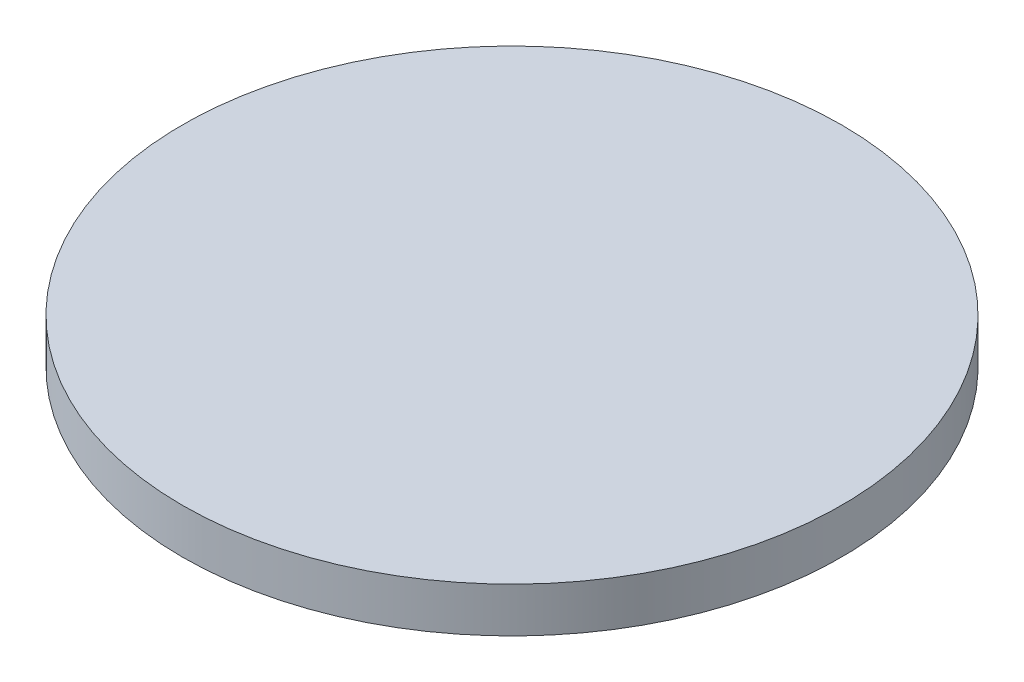
ISO-10303-21;
HEADER;
FILE_DESCRIPTION(('STEP AP214'),'2;1');
FILE_NAME('part.step','',(''),(''),'','','');
FILE_SCHEMA(('AUTOMOTIVE_DESIGN { 1 0 10303 214 1 1 1 1 }'));
ENDSEC;
DATA;
#1=APPLICATION_CONTEXT('core data for automotive mechanical design processes');
#2=APPLICATION_PROTOCOL_DEFINITION('international standard','automotive_design',2000,#1);
#3=PRODUCT_CONTEXT('',#1,'mechanical');
#4=PRODUCT('Part','Part','',(#3));
#5=PRODUCT_RELATED_PRODUCT_CATEGORY('part','',(#4));
#6=PRODUCT_DEFINITION_FORMATION('','',#4);
#7=PRODUCT_DEFINITION_CONTEXT('part definition',#1,'design');
#8=PRODUCT_DEFINITION('design','',#6,#7);
#9=PRODUCT_DEFINITION_SHAPE('','',#8);
#10=(LENGTH_UNIT() NAMED_UNIT(*) SI_UNIT(.MILLI.,.METRE.));
#11=(NAMED_UNIT(*) PLANE_ANGLE_UNIT() SI_UNIT($,.RADIAN.));
#12=(NAMED_UNIT(*) SI_UNIT($,.STERADIAN.) SOLID_ANGLE_UNIT());
#13=UNCERTAINTY_MEASURE_WITH_UNIT(LENGTH_MEASURE(1.E-05),#10,'distance_accuracy_value','');
#14=(GEOMETRIC_REPRESENTATION_CONTEXT(3) GLOBAL_UNCERTAINTY_ASSIGNED_CONTEXT((#13)) GLOBAL_UNIT_ASSIGNED_CONTEXT((#10,
#11,#12)) REPRESENTATION_CONTEXT('',''));
#15=CARTESIAN_POINT('',(0.,0.,0.));
#16=DIRECTION('',(0.,0.,1.));
#17=DIRECTION('',(1.,0.,0.));
#18=AXIS2_PLACEMENT_3D('',#15,#16,#17);
#19=CARTESIAN_POINT('',(0.,3.2,0.));
#20=DIRECTION('',(0.,-1.,0.));
#21=DIRECTION('',(0.,0.,-1.));
#22=AXIS2_PLACEMENT_3D('',#19,#20,#21);
#23=CYLINDRICAL_SURFACE('',#22,23.5);
#24=CARTESIAN_POINT('',(0.,3.2,0.));
#25=DIRECTION('',(0.,1.,0.));
#26=DIRECTION('',(0.,0.,1.));
#27=AXIS2_PLACEMENT_3D('',#24,#25,#26);
#28=CIRCLE('',#27,23.5);
#29=CARTESIAN_POINT('',(0.,3.2,23.5));
#30=VERTEX_POINT('',#29);
#31=EDGE_CURVE('E10',#30,#30,#28,.T.);
#32=ORIENTED_EDGE('',*,*,#31,.F.);
#33=EDGE_LOOP('',(#32));
#34=FACE_BOUND('',#33,.T.);
#35=CARTESIAN_POINT('',(0.,0.,0.));
#36=DIRECTION('',(0.,1.,0.));
#37=DIRECTION('',(0.,0.,1.));
#38=AXIS2_PLACEMENT_3D('',#35,#36,#37);
#39=CIRCLE('',#38,23.5);
#40=CARTESIAN_POINT('',(0.,0.,23.5));
#41=VERTEX_POINT('',#40);
#42=EDGE_CURVE('E34',#41,#41,#39,.T.);
#43=ORIENTED_EDGE('',*,*,#42,.T.);
#44=EDGE_LOOP('',(#43));
#45=FACE_BOUND('',#44,.T.);
#46=ADVANCED_FACE('F31',(#34,#45),#23,.T.);
#47=CARTESIAN_POINT('',(0.,3.2,0.));
#48=DIRECTION('',(0.,1.,0.));
#49=DIRECTION('',(0.,0.,1.));
#50=AXIS2_PLACEMENT_3D('',#47,#48,#49);
#51=PLANE('',#50);
#52=ORIENTED_EDGE('',*,*,#31,.T.);
#53=EDGE_LOOP('',(#52));
#54=FACE_BOUND('',#53,.T.);
#55=ADVANCED_FACE('F46',(#54),#51,.T.);
#56=CARTESIAN_POINT('',(0.,0.,0.));
#57=DIRECTION('',(0.,1.,0.));
#58=DIRECTION('',(0.,0.,1.));
#59=AXIS2_PLACEMENT_3D('',#56,#57,#58);
#60=PLANE('',#59);
#61=ORIENTED_EDGE('',*,*,#42,.F.);
#62=EDGE_LOOP('',(#61));
#63=FACE_BOUND('',#62,.T.);
#64=ADVANCED_FACE('F44',(#63),#60,.F.);
#65=CLOSED_SHELL('',(#46,#55,#64));
#66=MANIFOLD_SOLID_BREP('B2',#65);
#67=ADVANCED_BREP_SHAPE_REPRESENTATION('',(#18,#66),#14);
#68=SHAPE_DEFINITION_REPRESENTATION(#9,#67);
ENDSEC;
END-ISO-10303-21;
